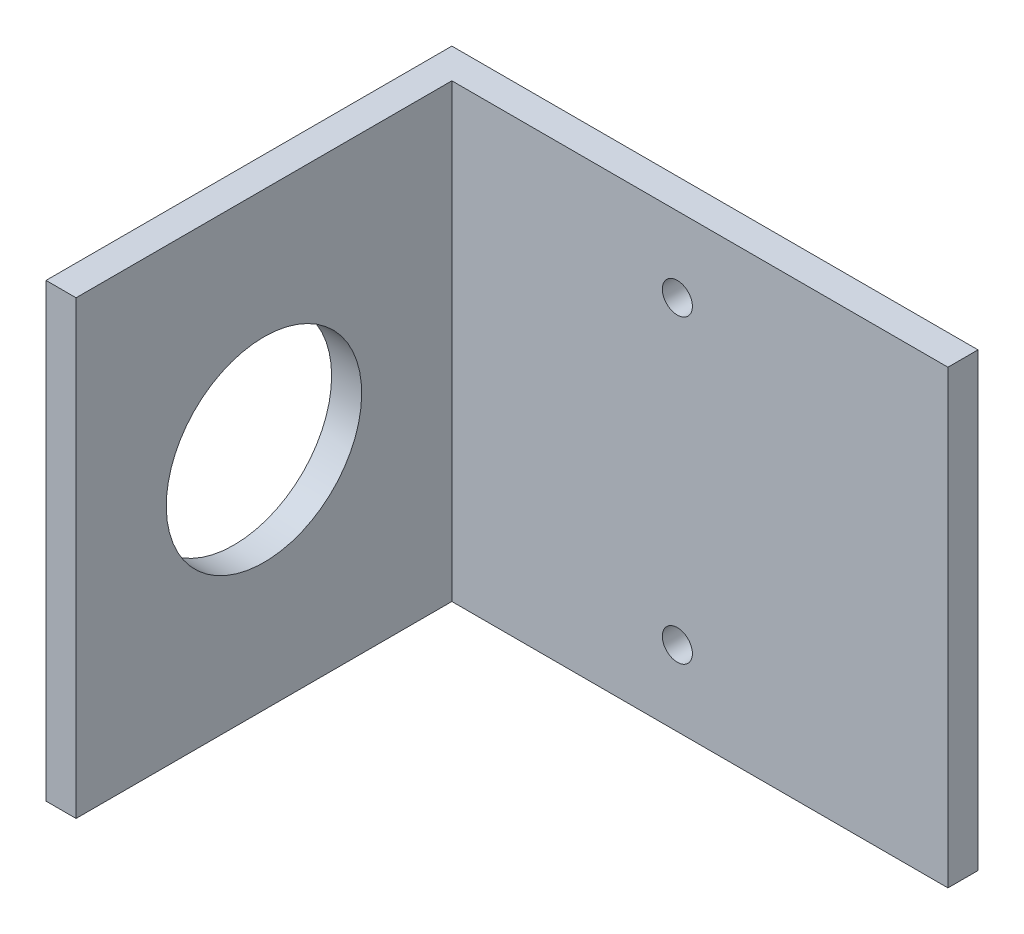
ISO-10303-21;
HEADER;
FILE_DESCRIPTION(('STEP AP214'),'2;1');
FILE_NAME('part.step','',(''),(''),'','','');
FILE_SCHEMA(('AUTOMOTIVE_DESIGN { 1 0 10303 214 1 1 1 1 }'));
ENDSEC;
DATA;
#1=APPLICATION_CONTEXT('core data for automotive mechanical design processes');
#2=APPLICATION_PROTOCOL_DEFINITION('international standard','automotive_design',2000,#1);
#3=PRODUCT_CONTEXT('',#1,'mechanical');
#4=PRODUCT('Part','Part','',(#3));
#5=PRODUCT_RELATED_PRODUCT_CATEGORY('part','',(#4));
#6=PRODUCT_DEFINITION_FORMATION('','',#4);
#7=PRODUCT_DEFINITION_CONTEXT('part definition',#1,'design');
#8=PRODUCT_DEFINITION('design','',#6,#7);
#9=PRODUCT_DEFINITION_SHAPE('','',#8);
#10=(LENGTH_UNIT() NAMED_UNIT(*) SI_UNIT(.MILLI.,.METRE.));
#11=(NAMED_UNIT(*) PLANE_ANGLE_UNIT() SI_UNIT($,.RADIAN.));
#12=(NAMED_UNIT(*) SI_UNIT($,.STERADIAN.) SOLID_ANGLE_UNIT());
#13=UNCERTAINTY_MEASURE_WITH_UNIT(LENGTH_MEASURE(1.E-05),#10,'distance_accuracy_value','');
#14=(GEOMETRIC_REPRESENTATION_CONTEXT(3) GLOBAL_UNCERTAINTY_ASSIGNED_CONTEXT((#13)) GLOBAL_UNIT_ASSIGNED_CONTEXT((#10,
#11,#12)) REPRESENTATION_CONTEXT('',''));
#15=CARTESIAN_POINT('',(0.,0.,0.));
#16=DIRECTION('',(0.,0.,1.));
#17=DIRECTION('',(1.,0.,0.));
#18=AXIS2_PLACEMENT_3D('',#15,#16,#17);
#19=CARTESIAN_POINT('',(35.,30.,4.));
#20=DIRECTION('',(-1.,0.,0.));
#21=DIRECTION('',(0.,-1.,0.));
#22=AXIS2_PLACEMENT_3D('',#19,#20,#21);
#23=PLANE('',#22);
#24=DIRECTION('',(0.,1.,0.));
#25=VECTOR('',#24,1.);
#26=CARTESIAN_POINT('',(35.,30.,0.));
#27=LINE('',#26,#25);
#28=CARTESIAN_POINT('',(35.,-30.,0.));
#29=VERTEX_POINT('',#28);
#30=CARTESIAN_POINT('',(35.,30.,0.));
#31=VERTEX_POINT('',#30);
#32=EDGE_CURVE('E90',#29,#31,#27,.T.);
#33=ORIENTED_EDGE('',*,*,#32,.T.);
#34=DIRECTION('',(0.,0.,-1.));
#35=VECTOR('',#34,1.);
#36=CARTESIAN_POINT('',(35.,30.,4.));
#37=LINE('',#36,#35);
#38=CARTESIAN_POINT('',(35.,30.,4.));
#39=VERTEX_POINT('',#38);
#40=EDGE_CURVE('E11',#39,#31,#37,.T.);
#41=ORIENTED_EDGE('',*,*,#40,.F.);
#42=DIRECTION('',(0.,1.,0.));
#43=VECTOR('',#42,1.);
#44=CARTESIAN_POINT('',(35.,30.,4.));
#45=LINE('',#44,#43);
#46=CARTESIAN_POINT('',(35.,-30.,4.));
#47=VERTEX_POINT('',#46);
#48=EDGE_CURVE('E84',#47,#39,#45,.T.);
#49=ORIENTED_EDGE('',*,*,#48,.F.);
#50=DIRECTION('',(0.,0.,-1.));
#51=VECTOR('',#50,1.);
#52=CARTESIAN_POINT('',(35.,-30.,4.));
#53=LINE('',#52,#51);
#54=EDGE_CURVE('E76',#47,#29,#53,.T.);
#55=ORIENTED_EDGE('',*,*,#54,.T.);
#56=EDGE_LOOP('',(#33,#41,#49,#55));
#57=FACE_BOUND('',#56,.T.);
#58=ADVANCED_FACE('F32',(#57),#23,.F.);
#59=CARTESIAN_POINT('',(-35.,30.,4.));
#60=DIRECTION('',(0.,-1.,0.));
#61=DIRECTION('',(0.,0.,-1.));
#62=AXIS2_PLACEMENT_3D('',#59,#60,#61);
#63=PLANE('',#62);
#64=DIRECTION('',(-1.,0.,0.));
#65=VECTOR('',#64,1.);
#66=CARTESIAN_POINT('',(-35.,30.,0.));
#67=LINE('',#66,#65);
#68=CARTESIAN_POINT('',(-35.,30.,0.));
#69=VERTEX_POINT('',#68);
#70=EDGE_CURVE('E93',#31,#69,#67,.T.);
#71=ORIENTED_EDGE('',*,*,#70,.T.);
#72=DIRECTION('',(0.,0.,-1.));
#73=VECTOR('',#72,1.);
#74=CARTESIAN_POINT('',(-35.,30.,4.));
#75=LINE('',#74,#73);
#76=CARTESIAN_POINT('',(-35.,30.,54.));
#77=VERTEX_POINT('',#76);
#78=EDGE_CURVE('E40',#77,#69,#75,.T.);
#79=ORIENTED_EDGE('',*,*,#78,.F.);
#80=DIRECTION('',(-1.,0.,0.));
#81=VECTOR('',#80,1.);
#82=CARTESIAN_POINT('',(-35.,30.,54.));
#83=LINE('',#82,#81);
#84=CARTESIAN_POINT('',(-31.,30.,54.));
#85=VERTEX_POINT('',#84);
#86=EDGE_CURVE('E135',#85,#77,#83,.T.);
#87=ORIENTED_EDGE('',*,*,#86,.F.);
#88=DIRECTION('',(0.,0.,-1.));
#89=VECTOR('',#88,1.);
#90=CARTESIAN_POINT('',(-31.,30.,54.));
#91=LINE('',#90,#89);
#92=CARTESIAN_POINT('',(-31.,30.,4.));
#93=VERTEX_POINT('',#92);
#94=EDGE_CURVE('E98',#85,#93,#91,.T.);
#95=ORIENTED_EDGE('',*,*,#94,.T.);
#96=DIRECTION('',(-1.,0.,0.));
#97=VECTOR('',#96,1.);
#98=CARTESIAN_POINT('',(-35.,30.,4.));
#99=LINE('',#98,#97);
#100=EDGE_CURVE('E141',#39,#93,#99,.T.);
#101=ORIENTED_EDGE('',*,*,#100,.F.);
#102=ORIENTED_EDGE('',*,*,#40,.T.);
#103=EDGE_LOOP('',(#71,#79,#87,#95,#101,#102));
#104=FACE_BOUND('',#103,.T.);
#105=ADVANCED_FACE('F153',(#104),#63,.F.);
#106=CARTESIAN_POINT('',(-35.,30.,4.));
#107=DIRECTION('',(1.,0.,0.));
#108=DIRECTION('',(0.,0.,-1.));
#109=AXIS2_PLACEMENT_3D('',#106,#107,#108);
#110=PLANE('',#109);
#111=CARTESIAN_POINT('',(-35.,0.,29.));
#112=DIRECTION('',(1.,0.,0.));
#113=DIRECTION('',(0.,0.,-1.));
#114=AXIS2_PLACEMENT_3D('',#111,#112,#113);
#115=CIRCLE('',#114,13.);
#116=CARTESIAN_POINT('',(-35.,0.,16.));
#117=VERTEX_POINT('',#116);
#118=EDGE_CURVE('E123',#117,#117,#115,.T.);
#119=ORIENTED_EDGE('',*,*,#118,.T.);
#120=EDGE_LOOP('',(#119));
#121=FACE_BOUND('',#120,.T.);
#122=DIRECTION('',(0.,-1.,0.));
#123=VECTOR('',#122,1.);
#124=CARTESIAN_POINT('',(-35.,30.,0.));
#125=LINE('',#124,#123);
#126=CARTESIAN_POINT('',(-35.,-30.,0.));
#127=VERTEX_POINT('',#126);
#128=EDGE_CURVE('E85',#69,#127,#125,.T.);
#129=ORIENTED_EDGE('',*,*,#128,.T.);
#130=DIRECTION('',(0.,0.,-1.));
#131=VECTOR('',#130,1.);
#132=CARTESIAN_POINT('',(-35.,-30.,4.));
#133=LINE('',#132,#131);
#134=CARTESIAN_POINT('',(-35.,-30.,54.));
#135=VERTEX_POINT('',#134);
#136=EDGE_CURVE('E80',#135,#127,#133,.T.);
#137=ORIENTED_EDGE('',*,*,#136,.F.);
#138=DIRECTION('',(0.,-1.,0.));
#139=VECTOR('',#138,1.);
#140=CARTESIAN_POINT('',(-35.,30.,54.));
#141=LINE('',#140,#139);
#142=EDGE_CURVE('E126',#77,#135,#141,.T.);
#143=ORIENTED_EDGE('',*,*,#142,.F.);
#144=ORIENTED_EDGE('',*,*,#78,.T.);
#145=EDGE_LOOP('',(#129,#137,#143,#144));
#146=FACE_BOUND('',#145,.T.);
#147=ADVANCED_FACE('F162',(#121,#146),#110,.F.);
#148=CARTESIAN_POINT('',(-35.,-30.,4.));
#149=DIRECTION('',(0.,1.,0.));
#150=DIRECTION('',(0.,0.,1.));
#151=AXIS2_PLACEMENT_3D('',#148,#149,#150);
#152=PLANE('',#151);
#153=DIRECTION('',(1.,0.,0.));
#154=VECTOR('',#153,1.);
#155=CARTESIAN_POINT('',(-35.,-30.,0.));
#156=LINE('',#155,#154);
#157=EDGE_CURVE('E73',#127,#29,#156,.T.);
#158=ORIENTED_EDGE('',*,*,#157,.T.);
#159=ORIENTED_EDGE('',*,*,#54,.F.);
#160=DIRECTION('',(1.,0.,0.));
#161=VECTOR('',#160,1.);
#162=CARTESIAN_POINT('',(-35.,-30.,4.));
#163=LINE('',#162,#161);
#164=CARTESIAN_POINT('',(-31.,-30.,4.));
#165=VERTEX_POINT('',#164);
#166=EDGE_CURVE('E53',#165,#47,#163,.T.);
#167=ORIENTED_EDGE('',*,*,#166,.F.);
#168=DIRECTION('',(0.,0.,-1.));
#169=VECTOR('',#168,1.);
#170=CARTESIAN_POINT('',(-31.,-30.,54.));
#171=LINE('',#170,#169);
#172=CARTESIAN_POINT('',(-31.,-30.,54.));
#173=VERTEX_POINT('',#172);
#174=EDGE_CURVE('E94',#173,#165,#171,.T.);
#175=ORIENTED_EDGE('',*,*,#174,.F.);
#176=DIRECTION('',(1.,0.,0.));
#177=VECTOR('',#176,1.);
#178=CARTESIAN_POINT('',(-35.,-30.,54.));
#179=LINE('',#178,#177);
#180=EDGE_CURVE('E129',#135,#173,#179,.T.);
#181=ORIENTED_EDGE('',*,*,#180,.F.);
#182=ORIENTED_EDGE('',*,*,#136,.T.);
#183=EDGE_LOOP('',(#158,#159,#167,#175,#181,#182));
#184=FACE_BOUND('',#183,.T.);
#185=ADVANCED_FACE('F75',(#184),#152,.F.);
#186=CARTESIAN_POINT('',(0.,0.,4.));
#187=DIRECTION('',(0.,0.,1.));
#188=DIRECTION('',(1.,0.,0.));
#189=AXIS2_PLACEMENT_3D('',#186,#187,#188);
#190=PLANE('',#189);
#191=CARTESIAN_POINT('',(-1.00000000000001,20.,4.));
#192=DIRECTION('',(0.,0.,1.));
#193=DIRECTION('',(1.,0.,0.));
#194=AXIS2_PLACEMENT_3D('',#191,#192,#193);
#195=CIRCLE('',#194,2.);
#196=CARTESIAN_POINT('',(0.99999999999999,20.,4.));
#197=VERTEX_POINT('',#196);
#198=EDGE_CURVE('E108',#197,#197,#195,.T.);
#199=ORIENTED_EDGE('',*,*,#198,.F.);
#200=EDGE_LOOP('',(#199));
#201=FACE_BOUND('',#200,.T.);
#202=CARTESIAN_POINT('',(-0.999999999999999,-20.,4.));
#203=DIRECTION('',(0.,0.,1.));
#204=DIRECTION('',(1.,0.,0.));
#205=AXIS2_PLACEMENT_3D('',#202,#203,#204);
#206=CIRCLE('',#205,2.);
#207=CARTESIAN_POINT('',(1.,-20.,4.));
#208=VERTEX_POINT('',#207);
#209=EDGE_CURVE('E114',#208,#208,#206,.T.);
#210=ORIENTED_EDGE('',*,*,#209,.F.);
#211=EDGE_LOOP('',(#210));
#212=FACE_BOUND('',#211,.T.);
#213=DIRECTION('',(0.,1.,0.));
#214=VECTOR('',#213,1.);
#215=CARTESIAN_POINT('',(-31.,30.,4.));
#216=LINE('',#215,#214);
#217=EDGE_CURVE('E48',#165,#93,#216,.T.);
#218=ORIENTED_EDGE('',*,*,#217,.F.);
#219=ORIENTED_EDGE('',*,*,#166,.T.);
#220=ORIENTED_EDGE('',*,*,#48,.T.);
#221=ORIENTED_EDGE('',*,*,#100,.T.);
#222=EDGE_LOOP('',(#218,#219,#220,#221));
#223=FACE_BOUND('',#222,.T.);
#224=ADVANCED_FACE('F143',(#201,#212,#223),#190,.T.);
#225=CARTESIAN_POINT('',(0.,0.,0.));
#226=DIRECTION('',(0.,0.,1.));
#227=DIRECTION('',(1.,0.,0.));
#228=AXIS2_PLACEMENT_3D('',#225,#226,#227);
#229=PLANE('',#228);
#230=CARTESIAN_POINT('',(-1.00000000000001,20.,0.));
#231=DIRECTION('',(0.,0.,1.));
#232=DIRECTION('',(1.,0.,0.));
#233=AXIS2_PLACEMENT_3D('',#230,#231,#232);
#234=CIRCLE('',#233,2.);
#235=CARTESIAN_POINT('',(0.99999999999999,20.,0.));
#236=VERTEX_POINT('',#235);
#237=EDGE_CURVE('E35',#236,#236,#234,.T.);
#238=ORIENTED_EDGE('',*,*,#237,.T.);
#239=EDGE_LOOP('',(#238));
#240=FACE_BOUND('',#239,.T.);
#241=CARTESIAN_POINT('',(-0.999999999999999,-20.,0.));
#242=DIRECTION('',(0.,0.,1.));
#243=DIRECTION('',(1.,0.,0.));
#244=AXIS2_PLACEMENT_3D('',#241,#242,#243);
#245=CIRCLE('',#244,2.);
#246=CARTESIAN_POINT('',(1.,-20.,0.));
#247=VERTEX_POINT('',#246);
#248=EDGE_CURVE('E106',#247,#247,#245,.T.);
#249=ORIENTED_EDGE('',*,*,#248,.T.);
#250=EDGE_LOOP('',(#249));
#251=FACE_BOUND('',#250,.T.);
#252=ORIENTED_EDGE('',*,*,#32,.F.);
#253=ORIENTED_EDGE('',*,*,#157,.F.);
#254=ORIENTED_EDGE('',*,*,#128,.F.);
#255=ORIENTED_EDGE('',*,*,#70,.F.);
#256=EDGE_LOOP('',(#252,#253,#254,#255));
#257=FACE_BOUND('',#256,.T.);
#258=ADVANCED_FACE('F92',(#240,#251,#257),#229,.F.);
#259=CARTESIAN_POINT('',(-31.,30.,54.));
#260=DIRECTION('',(-1.,0.,0.));
#261=DIRECTION('',(0.,-1.,0.));
#262=AXIS2_PLACEMENT_3D('',#259,#260,#261);
#263=PLANE('',#262);
#264=CARTESIAN_POINT('',(-31.,0.,29.));
#265=DIRECTION('',(1.,0.,0.));
#266=DIRECTION('',(0.,1.,0.));
#267=AXIS2_PLACEMENT_3D('',#264,#265,#266);
#268=CIRCLE('',#267,13.);
#269=CARTESIAN_POINT('',(-31.,13.,29.));
#270=VERTEX_POINT('',#269);
#271=EDGE_CURVE('E112',#270,#270,#268,.T.);
#272=ORIENTED_EDGE('',*,*,#271,.F.);
#273=EDGE_LOOP('',(#272));
#274=FACE_BOUND('',#273,.T.);
#275=ORIENTED_EDGE('',*,*,#217,.T.);
#276=ORIENTED_EDGE('',*,*,#94,.F.);
#277=DIRECTION('',(0.,1.,0.));
#278=VECTOR('',#277,1.);
#279=CARTESIAN_POINT('',(-31.,30.,54.));
#280=LINE('',#279,#278);
#281=EDGE_CURVE('E132',#173,#85,#280,.T.);
#282=ORIENTED_EDGE('',*,*,#281,.F.);
#283=ORIENTED_EDGE('',*,*,#174,.T.);
#284=EDGE_LOOP('',(#275,#276,#282,#283));
#285=FACE_BOUND('',#284,.T.);
#286=ADVANCED_FACE('F148',(#274,#285),#263,.F.);
#287=CARTESIAN_POINT('',(0.,0.,54.));
#288=DIRECTION('',(0.,0.,1.));
#289=DIRECTION('',(1.,0.,0.));
#290=AXIS2_PLACEMENT_3D('',#287,#288,#289);
#291=PLANE('',#290);
#292=ORIENTED_EDGE('',*,*,#142,.T.);
#293=ORIENTED_EDGE('',*,*,#180,.T.);
#294=ORIENTED_EDGE('',*,*,#281,.T.);
#295=ORIENTED_EDGE('',*,*,#86,.T.);
#296=EDGE_LOOP('',(#292,#293,#294,#295));
#297=FACE_BOUND('',#296,.T.);
#298=ADVANCED_FACE('F159',(#297),#291,.T.);
#299=CARTESIAN_POINT('',(-81.,0.,29.));
#300=DIRECTION('',(1.,0.,0.));
#301=DIRECTION('',(0.,1.,0.));
#302=AXIS2_PLACEMENT_3D('',#299,#300,#301);
#303=CYLINDRICAL_SURFACE('',#302,13.);
#304=ORIENTED_EDGE('',*,*,#271,.T.);
#305=EDGE_LOOP('',(#304));
#306=FACE_BOUND('',#305,.T.);
#307=ORIENTED_EDGE('',*,*,#118,.F.);
#308=EDGE_LOOP('',(#307));
#309=FACE_BOUND('',#308,.T.);
#310=ADVANCED_FACE('F200',(#306,#309),#303,.F.);
#311=CARTESIAN_POINT('',(-0.999999999999999,-20.,-46.));
#312=DIRECTION('',(0.,0.,1.));
#313=DIRECTION('',(1.,0.,0.));
#314=AXIS2_PLACEMENT_3D('',#311,#312,#313);
#315=CYLINDRICAL_SURFACE('',#314,2.);
#316=ORIENTED_EDGE('',*,*,#209,.T.);
#317=EDGE_LOOP('',(#316));
#318=FACE_BOUND('',#317,.T.);
#319=ORIENTED_EDGE('',*,*,#248,.F.);
#320=EDGE_LOOP('',(#319));
#321=FACE_BOUND('',#320,.T.);
#322=ADVANCED_FACE('F223',(#318,#321),#315,.F.);
#323=CARTESIAN_POINT('',(-1.00000000000001,20.,-46.));
#324=DIRECTION('',(0.,0.,1.));
#325=DIRECTION('',(1.,0.,0.));
#326=AXIS2_PLACEMENT_3D('',#323,#324,#325);
#327=CYLINDRICAL_SURFACE('',#326,2.);
#328=ORIENTED_EDGE('',*,*,#198,.T.);
#329=EDGE_LOOP('',(#328));
#330=FACE_BOUND('',#329,.T.);
#331=ORIENTED_EDGE('',*,*,#237,.F.);
#332=EDGE_LOOP('',(#331));
#333=FACE_BOUND('',#332,.T.);
#334=ADVANCED_FACE('F248',(#330,#333),#327,.F.);
#335=CLOSED_SHELL('',(#58,#105,#147,#185,#224,#258,#286,#298,#310,#322,#334));
#336=MANIFOLD_SOLID_BREP('B2',#335);
#337=ADVANCED_BREP_SHAPE_REPRESENTATION('',(#18,#336),#14);
#338=SHAPE_DEFINITION_REPRESENTATION(#9,#337);
ENDSEC;
END-ISO-10303-21;
